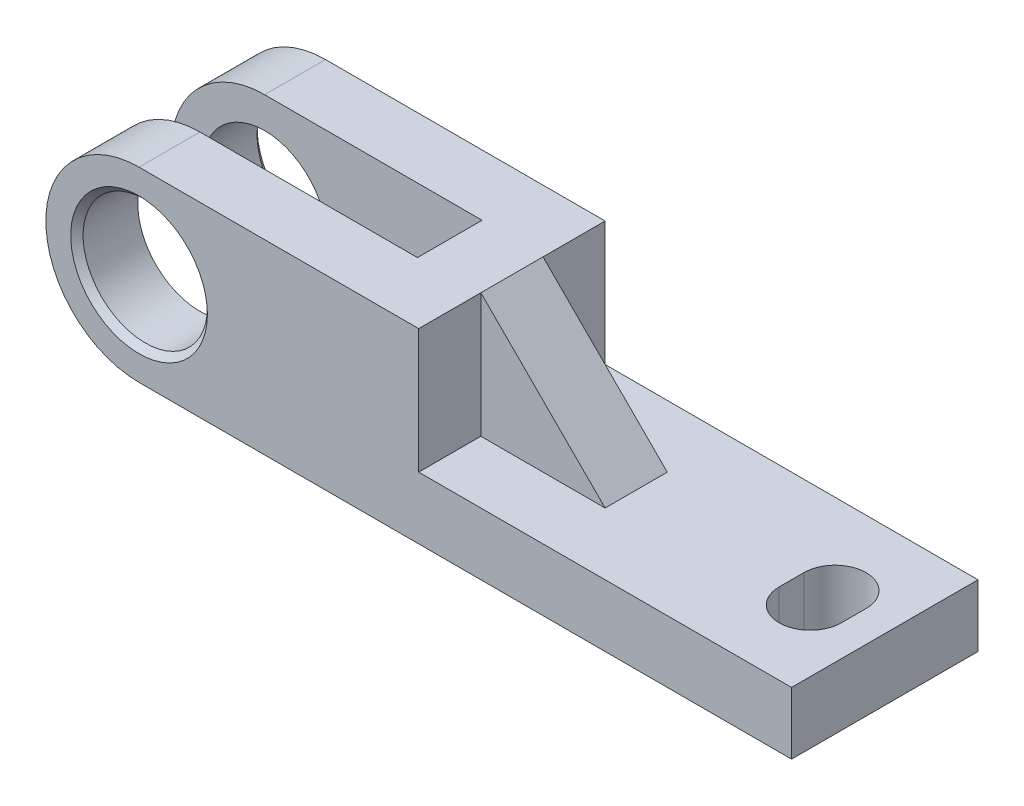
ISO-10303-21;
HEADER;
FILE_DESCRIPTION(('STEP AP214'),'2;1');
FILE_NAME('part.step','',(''),(''),'','','');
FILE_SCHEMA(('AUTOMOTIVE_DESIGN { 1 0 10303 214 1 1 1 1 }'));
ENDSEC;
DATA;
#1=APPLICATION_CONTEXT('core data for automotive mechanical design processes');
#2=APPLICATION_PROTOCOL_DEFINITION('international standard','automotive_design',2000,#1);
#3=PRODUCT_CONTEXT('',#1,'mechanical');
#4=PRODUCT('Part','Part','',(#3));
#5=PRODUCT_RELATED_PRODUCT_CATEGORY('part','',(#4));
#6=PRODUCT_DEFINITION_FORMATION('','',#4);
#7=PRODUCT_DEFINITION_CONTEXT('part definition',#1,'design');
#8=PRODUCT_DEFINITION('design','',#6,#7);
#9=PRODUCT_DEFINITION_SHAPE('','',#8);
#10=(LENGTH_UNIT() NAMED_UNIT(*) SI_UNIT(.MILLI.,.METRE.));
#11=(NAMED_UNIT(*) PLANE_ANGLE_UNIT() SI_UNIT($,.RADIAN.));
#12=(NAMED_UNIT(*) SI_UNIT($,.STERADIAN.) SOLID_ANGLE_UNIT());
#13=UNCERTAINTY_MEASURE_WITH_UNIT(LENGTH_MEASURE(1.E-05),#10,'distance_accuracy_value','');
#14=(GEOMETRIC_REPRESENTATION_CONTEXT(3) GLOBAL_UNCERTAINTY_ASSIGNED_CONTEXT((#13)) GLOBAL_UNIT_ASSIGNED_CONTEXT((#10,
#11,#12)) REPRESENTATION_CONTEXT('',''));
#15=CARTESIAN_POINT('',(0.,0.,0.));
#16=DIRECTION('',(0.,0.,1.));
#17=DIRECTION('',(1.,0.,0.));
#18=AXIS2_PLACEMENT_3D('',#15,#16,#17);
#19=CARTESIAN_POINT('',(21.6358024691358,0.,30.));
#20=DIRECTION('',(-1.,0.,0.));
#21=DIRECTION('',(0.,0.,1.));
#22=AXIS2_PLACEMENT_3D('',#19,#20,#21);
#23=PLANE('',#22);
#24=DIRECTION('',(0.,1.,0.));
#25=VECTOR('',#24,1.);
#26=CARTESIAN_POINT('',(21.6358024691358,0.,10.));
#27=LINE('',#26,#25);
#28=CARTESIAN_POINT('',(21.6358024691358,0.,10.));
#29=VERTEX_POINT('',#28);
#30=CARTESIAN_POINT('',(21.6358024691358,20.,10.));
#31=VERTEX_POINT('',#30);
#32=EDGE_CURVE('E175',#29,#31,#27,.T.);
#33=ORIENTED_EDGE('',*,*,#32,.F.);
#34=DIRECTION('',(0.,0.,-1.));
#35=VECTOR('',#34,1.);
#36=CARTESIAN_POINT('',(21.6358024691358,0.,30.));
#37=LINE('',#36,#35);
#38=CARTESIAN_POINT('',(21.6358024691358,0.,0.));
#39=VERTEX_POINT('',#38);
#40=EDGE_CURVE('E183',#29,#39,#37,.T.);
#41=ORIENTED_EDGE('',*,*,#40,.T.);
#42=DIRECTION('',(0.,1.,0.));
#43=VECTOR('',#42,1.);
#44=CARTESIAN_POINT('',(21.6358024691358,0.,0.));
#45=LINE('',#44,#43);
#46=CARTESIAN_POINT('',(21.6358024691358,20.,0.));
#47=VERTEX_POINT('',#46);
#48=EDGE_CURVE('E263',#39,#47,#45,.T.);
#49=ORIENTED_EDGE('',*,*,#48,.T.);
#50=DIRECTION('',(0.,0.,-1.));
#51=VECTOR('',#50,1.);
#52=CARTESIAN_POINT('',(21.6358024691358,20.,30.));
#53=LINE('',#52,#51);
#54=EDGE_CURVE('E254',#31,#47,#53,.T.);
#55=ORIENTED_EDGE('',*,*,#54,.F.);
#56=EDGE_LOOP('',(#33,#41,#49,#55));
#57=FACE_BOUND('',#56,.T.);
#58=ADVANCED_FACE('F40',(#57),#23,.F.);
#59=CARTESIAN_POINT('',(71.6358024691358,0.,17.));
#60=DIRECTION('',(0.,1.,0.));
#61=DIRECTION('',(-1.,0.,0.));
#62=AXIS2_PLACEMENT_3D('',#59,#60,#61);
#63=CYLINDRICAL_SURFACE('',#62,5.);
#64=DIRECTION('',(0.,-1.,0.));
#65=VECTOR('',#64,1.);
#66=CARTESIAN_POINT('',(66.6358024691358,0.,17.));
#67=LINE('',#66,#65);
#68=CARTESIAN_POINT('',(66.6358024691358,0.,17.));
#69=VERTEX_POINT('',#68);
#70=CARTESIAN_POINT('',(66.6358024691358,-10.,17.));
#71=VERTEX_POINT('',#70);
#72=EDGE_CURVE('E330',#69,#71,#67,.T.);
#73=ORIENTED_EDGE('',*,*,#72,.F.);
#74=CARTESIAN_POINT('',(71.6358024691358,0.,17.));
#75=DIRECTION('',(0.,-1.,0.));
#76=DIRECTION('',(1.,0.,0.));
#77=AXIS2_PLACEMENT_3D('',#74,#75,#76);
#78=CIRCLE('',#77,5.);
#79=CARTESIAN_POINT('',(76.6358024691358,0.,17.));
#80=VERTEX_POINT('',#79);
#81=EDGE_CURVE('E338',#69,#80,#78,.F.);
#82=ORIENTED_EDGE('',*,*,#81,.T.);
#83=DIRECTION('',(0.,-1.,0.));
#84=VECTOR('',#83,1.);
#85=CARTESIAN_POINT('',(76.6358024691358,0.,17.));
#86=LINE('',#85,#84);
#87=CARTESIAN_POINT('',(76.6358024691358,-10.,17.));
#88=VERTEX_POINT('',#87);
#89=EDGE_CURVE('E334',#88,#80,#86,.F.);
#90=ORIENTED_EDGE('',*,*,#89,.F.);
#91=CARTESIAN_POINT('',(71.6358024691358,-10.,17.));
#92=DIRECTION('',(0.,1.,0.));
#93=DIRECTION('',(0.,0.,1.));
#94=AXIS2_PLACEMENT_3D('',#91,#92,#93);
#95=CIRCLE('',#94,5.);
#96=EDGE_CURVE('E65',#88,#71,#95,.F.);
#97=ORIENTED_EDGE('',*,*,#96,.T.);
#98=EDGE_LOOP('',(#73,#82,#90,#97));
#99=FACE_BOUND('',#98,.T.);
#100=ADVANCED_FACE('F371',(#99),#63,.F.);
#101=CARTESIAN_POINT('',(71.6358024691358,-10.,13.));
#102=DIRECTION('',(0.,1.,0.));
#103=DIRECTION('',(-1.,0.,0.));
#104=AXIS2_PLACEMENT_3D('',#101,#102,#103);
#105=CYLINDRICAL_SURFACE('',#104,5.);
#106=DIRECTION('',(0.,-1.,0.));
#107=VECTOR('',#106,1.);
#108=CARTESIAN_POINT('',(66.6358024691358,-10.,13.));
#109=LINE('',#108,#107);
#110=CARTESIAN_POINT('',(66.6358024691358,-10.,13.));
#111=VERTEX_POINT('',#110);
#112=CARTESIAN_POINT('',(66.6358024691358,0.,13.));
#113=VERTEX_POINT('',#112);
#114=EDGE_CURVE('E315',#111,#113,#109,.F.);
#115=ORIENTED_EDGE('',*,*,#114,.F.);
#116=CARTESIAN_POINT('',(71.6358024691358,-10.,13.));
#117=DIRECTION('',(0.,1.,0.));
#118=DIRECTION('',(0.,0.,1.));
#119=AXIS2_PLACEMENT_3D('',#116,#117,#118);
#120=CIRCLE('',#119,5.);
#121=CARTESIAN_POINT('',(76.6358024691358,-10.,13.));
#122=VERTEX_POINT('',#121);
#123=EDGE_CURVE('E323',#111,#122,#120,.F.);
#124=ORIENTED_EDGE('',*,*,#123,.T.);
#125=DIRECTION('',(0.,-1.,0.));
#126=VECTOR('',#125,1.);
#127=CARTESIAN_POINT('',(76.6358024691358,-10.,13.));
#128=LINE('',#127,#126);
#129=CARTESIAN_POINT('',(76.6358024691358,0.,13.));
#130=VERTEX_POINT('',#129);
#131=EDGE_CURVE('E319',#130,#122,#128,.T.);
#132=ORIENTED_EDGE('',*,*,#131,.F.);
#133=CARTESIAN_POINT('',(71.6358024691358,0.,13.));
#134=DIRECTION('',(0.,-1.,0.));
#135=DIRECTION('',(1.,0.,0.));
#136=AXIS2_PLACEMENT_3D('',#133,#134,#135);
#137=CIRCLE('',#136,5.);
#138=EDGE_CURVE('E327',#130,#113,#137,.F.);
#139=ORIENTED_EDGE('',*,*,#138,.T.);
#140=EDGE_LOOP('',(#115,#124,#132,#139));
#141=FACE_BOUND('',#140,.T.);
#142=ADVANCED_FACE('F378',(#141),#105,.F.);
#143=CARTESIAN_POINT('',(-23.3641975308642,4.99999999999999,20.2));
#144=DIRECTION('',(0.,0.,-1.));
#145=DIRECTION('',(-1.,0.,0.));
#146=AXIS2_PLACEMENT_3D('',#143,#144,#145);
#147=CYLINDRICAL_SURFACE('',#146,15.);
#148=DIRECTION('',(0.,0.,-1.));
#149=VECTOR('',#148,1.);
#150=CARTESIAN_POINT('',(-23.3641975308642,20.,30.));
#151=LINE('',#150,#149);
#152=CARTESIAN_POINT('',(-23.3641975308642,20.,20.2));
#153=VERTEX_POINT('',#152);
#154=CARTESIAN_POINT('',(-23.3641975308642,20.,30.));
#155=VERTEX_POINT('',#154);
#156=EDGE_CURVE('E301',#153,#155,#151,.F.);
#157=ORIENTED_EDGE('',*,*,#156,.F.);
#158=CARTESIAN_POINT('',(-23.3641975308642,4.99999999999999,20.2));
#159=DIRECTION('',(0.,0.,1.));
#160=DIRECTION('',(1.,0.,0.));
#161=AXIS2_PLACEMENT_3D('',#158,#159,#160);
#162=CIRCLE('',#161,15.);
#163=CARTESIAN_POINT('',(-23.3641975308642,-10.,20.2));
#164=VERTEX_POINT('',#163);
#165=EDGE_CURVE('E309',#164,#153,#162,.F.);
#166=ORIENTED_EDGE('',*,*,#165,.F.);
#167=DIRECTION('',(0.,0.,-1.));
#168=VECTOR('',#167,1.);
#169=CARTESIAN_POINT('',(-23.3641975308642,-10.,30.));
#170=LINE('',#169,#168);
#171=CARTESIAN_POINT('',(-23.3641975308642,-10.,30.));
#172=VERTEX_POINT('',#171);
#173=EDGE_CURVE('E305',#172,#164,#170,.T.);
#174=ORIENTED_EDGE('',*,*,#173,.F.);
#175=CARTESIAN_POINT('',(-23.3641975308642,4.99999999999999,30.));
#176=DIRECTION('',(0.,0.,1.));
#177=DIRECTION('',(1.,0.,0.));
#178=AXIS2_PLACEMENT_3D('',#175,#176,#177);
#179=CIRCLE('',#178,15.);
#180=EDGE_CURVE('E312',#155,#172,#179,.T.);
#181=ORIENTED_EDGE('',*,*,#180,.F.);
#182=EDGE_LOOP('',(#157,#166,#174,#181));
#183=FACE_BOUND('',#182,.T.);
#184=ADVANCED_FACE('F485',(#183),#147,.T.);
#185=CARTESIAN_POINT('',(-23.3641975308642,5.,0.));
#186=DIRECTION('',(0.,0.,-1.));
#187=DIRECTION('',(-1.,0.,0.));
#188=AXIS2_PLACEMENT_3D('',#185,#186,#187);
#189=CYLINDRICAL_SURFACE('',#188,15.);
#190=DIRECTION('',(0.,0.,-1.));
#191=VECTOR('',#190,1.);
#192=CARTESIAN_POINT('',(-23.3641975308642,20.,30.));
#193=LINE('',#192,#191);
#194=CARTESIAN_POINT('',(-23.3641975308642,20.,0.));
#195=VERTEX_POINT('',#194);
#196=CARTESIAN_POINT('',(-23.3641975308642,20.,9.8));
#197=VERTEX_POINT('',#196);
#198=EDGE_CURVE('E287',#195,#197,#193,.F.);
#199=ORIENTED_EDGE('',*,*,#198,.F.);
#200=CARTESIAN_POINT('',(-23.3641975308642,5.,0.));
#201=DIRECTION('',(0.,0.,1.));
#202=DIRECTION('',(1.,0.,0.));
#203=AXIS2_PLACEMENT_3D('',#200,#201,#202);
#204=CIRCLE('',#203,15.);
#205=CARTESIAN_POINT('',(-23.3641975308642,-10.,0.));
#206=VERTEX_POINT('',#205);
#207=EDGE_CURVE('E295',#206,#195,#204,.F.);
#208=ORIENTED_EDGE('',*,*,#207,.F.);
#209=DIRECTION('',(0.,0.,-1.));
#210=VECTOR('',#209,1.);
#211=CARTESIAN_POINT('',(-23.3641975308642,-10.,30.));
#212=LINE('',#211,#210);
#213=CARTESIAN_POINT('',(-23.3641975308642,-10.,9.8));
#214=VERTEX_POINT('',#213);
#215=EDGE_CURVE('E291',#214,#206,#212,.T.);
#216=ORIENTED_EDGE('',*,*,#215,.F.);
#217=CARTESIAN_POINT('',(-23.3641975308642,5.,9.8));
#218=DIRECTION('',(0.,0.,-1.));
#219=DIRECTION('',(-1.,0.,0.));
#220=AXIS2_PLACEMENT_3D('',#217,#218,#219);
#221=CIRCLE('',#220,15.);
#222=EDGE_CURVE('E298',#197,#214,#221,.F.);
#223=ORIENTED_EDGE('',*,*,#222,.F.);
#224=EDGE_LOOP('',(#199,#208,#216,#223));
#225=FACE_BOUND('',#224,.T.);
#226=ADVANCED_FACE('F478',(#225),#189,.T.);
#227=CARTESIAN_POINT('',(-38.3641975308642,-10.,30.));
#228=DIRECTION('',(0.,1.,0.));
#229=DIRECTION('',(0.,0.,1.));
#230=AXIS2_PLACEMENT_3D('',#227,#228,#229);
#231=PLANE('',#230);
#232=ORIENTED_EDGE('',*,*,#96,.F.);
#233=DIRECTION('',(0.,0.,-1.));
#234=VECTOR('',#233,1.);
#235=CARTESIAN_POINT('',(76.6358024691358,-10.,8.));
#236=LINE('',#235,#234);
#237=EDGE_CURVE('E198',#88,#122,#236,.T.);
#238=ORIENTED_EDGE('',*,*,#237,.T.);
#239=ORIENTED_EDGE('',*,*,#123,.F.);
#240=DIRECTION('',(0.,0.,1.));
#241=VECTOR('',#240,1.);
#242=CARTESIAN_POINT('',(66.6358024691358,-10.,8.));
#243=LINE('',#242,#241);
#244=EDGE_CURVE('E195',#111,#71,#243,.T.);
#245=ORIENTED_EDGE('',*,*,#244,.T.);
#246=EDGE_LOOP('',(#232,#238,#239,#245));
#247=FACE_BOUND('',#246,.T.);
#248=DIRECTION('',(-1.,0.,0.));
#249=VECTOR('',#248,1.);
#250=CARTESIAN_POINT('',(11.6358024691358,-10.,20.2));
#251=LINE('',#250,#249);
#252=CARTESIAN_POINT('',(11.6358024691358,-10.,20.2));
#253=VERTEX_POINT('',#252);
#254=EDGE_CURVE('E230',#253,#164,#251,.T.);
#255=ORIENTED_EDGE('',*,*,#254,.F.);
#256=DIRECTION('',(0.,0.,1.));
#257=VECTOR('',#256,1.);
#258=CARTESIAN_POINT('',(11.6358024691358,-10.,9.8));
#259=LINE('',#258,#257);
#260=CARTESIAN_POINT('',(11.6358024691358,-10.,9.8));
#261=VERTEX_POINT('',#260);
#262=EDGE_CURVE('E211',#261,#253,#259,.T.);
#263=ORIENTED_EDGE('',*,*,#262,.F.);
#264=DIRECTION('',(-1.,0.,0.));
#265=VECTOR('',#264,1.);
#266=CARTESIAN_POINT('',(11.6358024691358,-10.,9.8));
#267=LINE('',#266,#265);
#268=EDGE_CURVE('E220',#261,#214,#267,.T.);
#269=ORIENTED_EDGE('',*,*,#268,.T.);
#270=ORIENTED_EDGE('',*,*,#215,.T.);
#271=DIRECTION('',(1.,0.,0.));
#272=VECTOR('',#271,1.);
#273=CARTESIAN_POINT('',(-38.3641975308642,-10.,0.));
#274=LINE('',#273,#272);
#275=CARTESIAN_POINT('',(81.6358024691358,-10.,0.));
#276=VERTEX_POINT('',#275);
#277=EDGE_CURVE('E225',#206,#276,#274,.T.);
#278=ORIENTED_EDGE('',*,*,#277,.T.);
#279=DIRECTION('',(0.,0.,-1.));
#280=VECTOR('',#279,1.);
#281=CARTESIAN_POINT('',(81.6358024691358,-10.,30.));
#282=LINE('',#281,#280);
#283=CARTESIAN_POINT('',(81.6358024691358,-10.,30.));
#284=VERTEX_POINT('',#283);
#285=EDGE_CURVE('E283',#284,#276,#282,.T.);
#286=ORIENTED_EDGE('',*,*,#285,.F.);
#287=DIRECTION('',(1.,0.,0.));
#288=VECTOR('',#287,1.);
#289=CARTESIAN_POINT('',(-38.3641975308642,-10.,30.));
#290=LINE('',#289,#288);
#291=EDGE_CURVE('E237',#172,#284,#290,.T.);
#292=ORIENTED_EDGE('',*,*,#291,.F.);
#293=ORIENTED_EDGE('',*,*,#173,.T.);
#294=EDGE_LOOP('',(#255,#263,#269,#270,#278,#286,#292,#293));
#295=FACE_BOUND('',#294,.T.);
#296=ADVANCED_FACE('F460',(#247,#295),#231,.F.);
#297=CARTESIAN_POINT('',(81.6358024691358,-10.,30.));
#298=DIRECTION('',(-1.,0.,0.));
#299=DIRECTION('',(0.,0.,1.));
#300=AXIS2_PLACEMENT_3D('',#297,#298,#299);
#301=PLANE('',#300);
#302=DIRECTION('',(0.,1.,0.));
#303=VECTOR('',#302,1.);
#304=CARTESIAN_POINT('',(81.6358024691358,-10.,0.));
#305=LINE('',#304,#303);
#306=CARTESIAN_POINT('',(81.6358024691358,0.,0.));
#307=VERTEX_POINT('',#306);
#308=EDGE_CURVE('E257',#276,#307,#305,.T.);
#309=ORIENTED_EDGE('',*,*,#308,.T.);
#310=DIRECTION('',(0.,0.,-1.));
#311=VECTOR('',#310,1.);
#312=CARTESIAN_POINT('',(81.6358024691358,0.,30.));
#313=LINE('',#312,#311);
#314=CARTESIAN_POINT('',(81.6358024691358,0.,30.));
#315=VERTEX_POINT('',#314);
#316=EDGE_CURVE('E279',#315,#307,#313,.T.);
#317=ORIENTED_EDGE('',*,*,#316,.F.);
#318=DIRECTION('',(0.,1.,0.));
#319=VECTOR('',#318,1.);
#320=CARTESIAN_POINT('',(81.6358024691358,-10.,30.));
#321=LINE('',#320,#319);
#322=EDGE_CURVE('E240',#284,#315,#321,.T.);
#323=ORIENTED_EDGE('',*,*,#322,.F.);
#324=ORIENTED_EDGE('',*,*,#285,.T.);
#325=EDGE_LOOP('',(#309,#317,#323,#324));
#326=FACE_BOUND('',#325,.T.);
#327=ADVANCED_FACE('F392',(#326),#301,.F.);
#328=CARTESIAN_POINT('',(81.6358024691358,0.,30.));
#329=DIRECTION('',(0.,-1.,0.));
#330=DIRECTION('',(1.,0.,0.));
#331=AXIS2_PLACEMENT_3D('',#328,#329,#330);
#332=PLANE('',#331);
#333=ORIENTED_EDGE('',*,*,#81,.F.);
#334=DIRECTION('',(0.,0.,1.));
#335=VECTOR('',#334,1.);
#336=CARTESIAN_POINT('',(66.6358024691358,0.,8.));
#337=LINE('',#336,#335);
#338=EDGE_CURVE('E168',#113,#69,#337,.T.);
#339=ORIENTED_EDGE('',*,*,#338,.F.);
#340=ORIENTED_EDGE('',*,*,#138,.F.);
#341=DIRECTION('',(0.,0.,-1.));
#342=VECTOR('',#341,1.);
#343=CARTESIAN_POINT('',(76.6358024691358,0.,8.));
#344=LINE('',#343,#342);
#345=EDGE_CURVE('E199',#80,#130,#344,.T.);
#346=ORIENTED_EDGE('',*,*,#345,.F.);
#347=EDGE_LOOP('',(#333,#339,#340,#346));
#348=FACE_BOUND('',#347,.T.);
#349=DIRECTION('',(0.,0.,-1.));
#350=VECTOR('',#349,1.);
#351=CARTESIAN_POINT('',(41.6358024691358,0.,30.));
#352=LINE('',#351,#350);
#353=CARTESIAN_POINT('',(41.6358024691358,0.,10.));
#354=VERTEX_POINT('',#353);
#355=CARTESIAN_POINT('',(41.6358024691358,0.,20.));
#356=VERTEX_POINT('',#355);
#357=EDGE_CURVE('E160',#354,#356,#352,.F.);
#358=ORIENTED_EDGE('',*,*,#357,.T.);
#359=DIRECTION('',(-1.,0.,0.));
#360=VECTOR('',#359,1.);
#361=CARTESIAN_POINT('',(81.6358024691358,0.,20.));
#362=LINE('',#361,#360);
#363=CARTESIAN_POINT('',(21.6358024691358,0.,20.));
#364=VERTEX_POINT('',#363);
#365=EDGE_CURVE('E169',#356,#364,#362,.T.);
#366=ORIENTED_EDGE('',*,*,#365,.T.);
#367=CARTESIAN_POINT('',(21.6358024691358,0.,30.));
#368=VERTEX_POINT('',#367);
#369=EDGE_CURVE('E275',#368,#364,#37,.T.);
#370=ORIENTED_EDGE('',*,*,#369,.F.);
#371=DIRECTION('',(-1.,0.,0.));
#372=VECTOR('',#371,1.);
#373=CARTESIAN_POINT('',(81.6358024691358,0.,30.));
#374=LINE('',#373,#372);
#375=EDGE_CURVE('E244',#315,#368,#374,.T.);
#376=ORIENTED_EDGE('',*,*,#375,.F.);
#377=ORIENTED_EDGE('',*,*,#316,.T.);
#378=DIRECTION('',(-1.,0.,0.));
#379=VECTOR('',#378,1.);
#380=CARTESIAN_POINT('',(81.6358024691358,0.,0.));
#381=LINE('',#380,#379);
#382=EDGE_CURVE('E260',#307,#39,#381,.T.);
#383=ORIENTED_EDGE('',*,*,#382,.T.);
#384=ORIENTED_EDGE('',*,*,#40,.F.);
#385=DIRECTION('',(-1.,0.,0.));
#386=VECTOR('',#385,1.);
#387=CARTESIAN_POINT('',(81.6358024691358,0.,10.));
#388=LINE('',#387,#386);
#389=EDGE_CURVE('E173',#354,#29,#388,.T.);
#390=ORIENTED_EDGE('',*,*,#389,.F.);
#391=EDGE_LOOP('',(#358,#366,#370,#376,#377,#383,#384,#390));
#392=FACE_BOUND('',#391,.T.);
#393=ADVANCED_FACE('F181',(#348,#392),#332,.F.);
#394=ORIENTED_EDGE('',*,*,#369,.T.);
#395=DIRECTION('',(0.,1.,0.));
#396=VECTOR('',#395,1.);
#397=CARTESIAN_POINT('',(21.6358024691358,0.,20.));
#398=LINE('',#397,#396);
#399=CARTESIAN_POINT('',(21.6358024691358,20.,20.));
#400=VERTEX_POINT('',#399);
#401=EDGE_CURVE('E185',#364,#400,#398,.T.);
#402=ORIENTED_EDGE('',*,*,#401,.T.);
#403=CARTESIAN_POINT('',(21.6358024691358,20.,30.));
#404=VERTEX_POINT('',#403);
#405=EDGE_CURVE('E270',#404,#400,#53,.T.);
#406=ORIENTED_EDGE('',*,*,#405,.F.);
#407=DIRECTION('',(0.,1.,0.));
#408=VECTOR('',#407,1.);
#409=CARTESIAN_POINT('',(21.6358024691358,0.,30.));
#410=LINE('',#409,#408);
#411=EDGE_CURVE('E247',#368,#404,#410,.T.);
#412=ORIENTED_EDGE('',*,*,#411,.F.);
#413=EDGE_LOOP('',(#394,#402,#406,#412));
#414=FACE_BOUND('',#413,.T.);
#415=ADVANCED_FACE('F374',(#414),#23,.F.);
#416=CARTESIAN_POINT('',(21.6358024691358,20.,30.));
#417=DIRECTION('',(0.,-1.,0.));
#418=DIRECTION('',(1.,0.,0.));
#419=AXIS2_PLACEMENT_3D('',#416,#417,#418);
#420=PLANE('',#419);
#421=ORIENTED_EDGE('',*,*,#405,.T.);
#422=EDGE_CURVE('E274',#400,#31,#53,.T.);
#423=ORIENTED_EDGE('',*,*,#422,.T.);
#424=ORIENTED_EDGE('',*,*,#54,.T.);
#425=DIRECTION('',(-1.,0.,0.));
#426=VECTOR('',#425,1.);
#427=CARTESIAN_POINT('',(21.6358024691358,20.,0.));
#428=LINE('',#427,#426);
#429=EDGE_CURVE('E241',#47,#195,#428,.T.);
#430=ORIENTED_EDGE('',*,*,#429,.T.);
#431=ORIENTED_EDGE('',*,*,#198,.T.);
#432=DIRECTION('',(-1.,0.,0.));
#433=VECTOR('',#432,1.);
#434=CARTESIAN_POINT('',(11.6358024691358,20.,9.8));
#435=LINE('',#434,#433);
#436=CARTESIAN_POINT('',(11.6358024691358,20.,9.8));
#437=VERTEX_POINT('',#436);
#438=EDGE_CURVE('E221',#437,#197,#435,.T.);
#439=ORIENTED_EDGE('',*,*,#438,.F.);
#440=DIRECTION('',(0.,0.,-1.));
#441=VECTOR('',#440,1.);
#442=CARTESIAN_POINT('',(11.6358024691358,20.,9.8));
#443=LINE('',#442,#441);
#444=CARTESIAN_POINT('',(11.6358024691358,20.,20.2));
#445=VERTEX_POINT('',#444);
#446=EDGE_CURVE('E217',#445,#437,#443,.T.);
#447=ORIENTED_EDGE('',*,*,#446,.F.);
#448=DIRECTION('',(-1.,0.,0.));
#449=VECTOR('',#448,1.);
#450=CARTESIAN_POINT('',(11.6358024691358,20.,20.2));
#451=LINE('',#450,#449);
#452=EDGE_CURVE('E226',#445,#153,#451,.T.);
#453=ORIENTED_EDGE('',*,*,#452,.T.);
#454=ORIENTED_EDGE('',*,*,#156,.T.);
#455=DIRECTION('',(-1.,0.,0.));
#456=VECTOR('',#455,1.);
#457=CARTESIAN_POINT('',(21.6358024691358,20.,30.));
#458=LINE('',#457,#456);
#459=EDGE_CURVE('E250',#404,#155,#458,.T.);
#460=ORIENTED_EDGE('',*,*,#459,.F.);
#461=EDGE_LOOP('',(#421,#423,#424,#430,#431,#439,#447,#453,#454,#460));
#462=FACE_BOUND('',#461,.T.);
#463=ADVANCED_FACE('F384',(#462),#420,.F.);
#464=CARTESIAN_POINT('',(0.,0.,30.));
#465=DIRECTION('',(0.,0.,1.));
#466=DIRECTION('',(1.,0.,0.));
#467=AXIS2_PLACEMENT_3D('',#464,#465,#466);
#468=PLANE('',#467);
#469=CARTESIAN_POINT('',(-23.3641975308642,4.99999999999999,30.));
#470=DIRECTION('',(0.,0.,1.));
#471=DIRECTION('',(1.,0.,0.));
#472=AXIS2_PLACEMENT_3D('',#469,#470,#471);
#473=CIRCLE('',#472,11.);
#474=CARTESIAN_POINT('',(-12.3641975308642,4.99999999999999,30.));
#475=VERTEX_POINT('',#474);
#476=EDGE_CURVE('E11',#475,#475,#473,.F.);
#477=ORIENTED_EDGE('',*,*,#476,.T.);
#478=EDGE_LOOP('',(#477));
#479=FACE_BOUND('',#478,.T.);
#480=ORIENTED_EDGE('',*,*,#459,.T.);
#481=ORIENTED_EDGE('',*,*,#180,.T.);
#482=ORIENTED_EDGE('',*,*,#291,.T.);
#483=ORIENTED_EDGE('',*,*,#322,.T.);
#484=ORIENTED_EDGE('',*,*,#375,.T.);
#485=ORIENTED_EDGE('',*,*,#411,.T.);
#486=EDGE_LOOP('',(#480,#481,#482,#483,#484,#485));
#487=FACE_BOUND('',#486,.T.);
#488=ADVANCED_FACE('F390',(#479,#487),#468,.T.);
#489=CARTESIAN_POINT('',(0.,0.,0.));
#490=DIRECTION('',(0.,0.,1.));
#491=DIRECTION('',(1.,0.,0.));
#492=AXIS2_PLACEMENT_3D('',#489,#490,#491);
#493=PLANE('',#492);
#494=CARTESIAN_POINT('',(-23.3641975308642,4.99999999999999,0.));
#495=DIRECTION('',(0.,0.,1.));
#496=DIRECTION('',(1.,0.,0.));
#497=AXIS2_PLACEMENT_3D('',#494,#495,#496);
#498=CIRCLE('',#497,11.);
#499=CARTESIAN_POINT('',(-12.3641975308642,4.99999999999999,0.));
#500=VERTEX_POINT('',#499);
#501=EDGE_CURVE('E343',#500,#500,#498,.T.);
#502=ORIENTED_EDGE('',*,*,#501,.T.);
#503=EDGE_LOOP('',(#502));
#504=FACE_BOUND('',#503,.T.);
#505=ORIENTED_EDGE('',*,*,#277,.F.);
#506=ORIENTED_EDGE('',*,*,#207,.T.);
#507=ORIENTED_EDGE('',*,*,#429,.F.);
#508=ORIENTED_EDGE('',*,*,#48,.F.);
#509=ORIENTED_EDGE('',*,*,#382,.F.);
#510=ORIENTED_EDGE('',*,*,#308,.F.);
#511=EDGE_LOOP('',(#505,#506,#507,#508,#509,#510));
#512=FACE_BOUND('',#511,.T.);
#513=ADVANCED_FACE('F442',(#504,#512),#493,.F.);
#514=CARTESIAN_POINT('',(11.6358024691358,-10.,9.8));
#515=DIRECTION('',(0.,0.,-1.));
#516=DIRECTION('',(-1.,0.,0.));
#517=AXIS2_PLACEMENT_3D('',#514,#515,#516);
#518=PLANE('',#517);
#519=CARTESIAN_POINT('',(-23.3641975308642,4.99999999999999,9.8));
#520=DIRECTION('',(0.,0.,-1.));
#521=DIRECTION('',(-1.,0.,0.));
#522=AXIS2_PLACEMENT_3D('',#519,#520,#521);
#523=CIRCLE('',#522,10.);
#524=CARTESIAN_POINT('',(-33.3641975308642,4.99999999999999,9.8));
#525=VERTEX_POINT('',#524);
#526=EDGE_CURVE('E178',#525,#525,#523,.T.);
#527=ORIENTED_EDGE('',*,*,#526,.T.);
#528=EDGE_LOOP('',(#527));
#529=FACE_BOUND('',#528,.T.);
#530=ORIENTED_EDGE('',*,*,#438,.T.);
#531=ORIENTED_EDGE('',*,*,#222,.T.);
#532=ORIENTED_EDGE('',*,*,#268,.F.);
#533=DIRECTION('',(0.,-1.,0.));
#534=VECTOR('',#533,1.);
#535=CARTESIAN_POINT('',(11.6358024691358,-10.,9.8));
#536=LINE('',#535,#534);
#537=EDGE_CURVE('E202',#437,#261,#536,.T.);
#538=ORIENTED_EDGE('',*,*,#537,.F.);
#539=EDGE_LOOP('',(#530,#531,#532,#538));
#540=FACE_BOUND('',#539,.T.);
#541=ADVANCED_FACE('F407',(#529,#540),#518,.F.);
#542=CARTESIAN_POINT('',(11.6358024691358,-10.,20.2));
#543=DIRECTION('',(0.,0.,1.));
#544=DIRECTION('',(1.,0.,0.));
#545=AXIS2_PLACEMENT_3D('',#542,#543,#544);
#546=PLANE('',#545);
#547=CARTESIAN_POINT('',(-23.3641975308642,4.99999999999999,20.2));
#548=DIRECTION('',(0.,0.,1.));
#549=DIRECTION('',(1.,0.,0.));
#550=AXIS2_PLACEMENT_3D('',#547,#548,#549);
#551=CIRCLE('',#550,10.);
#552=CARTESIAN_POINT('',(-13.3641975308642,4.99999999999999,20.2));
#553=VERTEX_POINT('',#552);
#554=EDGE_CURVE('E344',#553,#553,#551,.T.);
#555=ORIENTED_EDGE('',*,*,#554,.T.);
#556=EDGE_LOOP('',(#555));
#557=FACE_BOUND('',#556,.T.);
#558=ORIENTED_EDGE('',*,*,#254,.T.);
#559=ORIENTED_EDGE('',*,*,#165,.T.);
#560=ORIENTED_EDGE('',*,*,#452,.F.);
#561=DIRECTION('',(0.,1.,0.));
#562=VECTOR('',#561,1.);
#563=CARTESIAN_POINT('',(11.6358024691358,-10.,20.2));
#564=LINE('',#563,#562);
#565=EDGE_CURVE('E214',#253,#445,#564,.T.);
#566=ORIENTED_EDGE('',*,*,#565,.F.);
#567=EDGE_LOOP('',(#558,#559,#560,#566));
#568=FACE_BOUND('',#567,.T.);
#569=ADVANCED_FACE('F435',(#557,#568),#546,.F.);
#570=CARTESIAN_POINT('',(11.6358024691358,0.,0.));
#571=DIRECTION('',(1.,0.,0.));
#572=DIRECTION('',(0.,0.,-1.));
#573=AXIS2_PLACEMENT_3D('',#570,#571,#572);
#574=PLANE('',#573);
#575=ORIENTED_EDGE('',*,*,#446,.T.);
#576=ORIENTED_EDGE('',*,*,#537,.T.);
#577=ORIENTED_EDGE('',*,*,#262,.T.);
#578=ORIENTED_EDGE('',*,*,#565,.T.);
#579=EDGE_LOOP('',(#575,#576,#577,#578));
#580=FACE_BOUND('',#579,.T.);
#581=ADVANCED_FACE('F431',(#580),#574,.F.);
#582=CARTESIAN_POINT('',(66.6358024691358,-10.,8.));
#583=DIRECTION('',(-1.,0.,0.));
#584=DIRECTION('',(0.,-1.,0.));
#585=AXIS2_PLACEMENT_3D('',#582,#583,#584);
#586=PLANE('',#585);
#587=ORIENTED_EDGE('',*,*,#338,.T.);
#588=ORIENTED_EDGE('',*,*,#72,.T.);
#589=ORIENTED_EDGE('',*,*,#244,.F.);
#590=ORIENTED_EDGE('',*,*,#114,.T.);
#591=EDGE_LOOP('',(#587,#588,#589,#590));
#592=FACE_BOUND('',#591,.T.);
#593=ADVANCED_FACE('F427',(#592),#586,.F.);
#594=CARTESIAN_POINT('',(76.6358024691358,-10.,8.));
#595=DIRECTION('',(1.,0.,0.));
#596=DIRECTION('',(0.,1.,0.));
#597=AXIS2_PLACEMENT_3D('',#594,#595,#596);
#598=PLANE('',#597);
#599=ORIENTED_EDGE('',*,*,#237,.F.);
#600=ORIENTED_EDGE('',*,*,#89,.T.);
#601=ORIENTED_EDGE('',*,*,#345,.T.);
#602=ORIENTED_EDGE('',*,*,#131,.T.);
#603=EDGE_LOOP('',(#599,#600,#601,#602));
#604=FACE_BOUND('',#603,.T.);
#605=ADVANCED_FACE('F424',(#604),#598,.F.);
#606=CARTESIAN_POINT('',(21.6358024691358,20.,15.));
#607=DIRECTION('',(-0.707106781186547,-0.707106781186548,0.));
#608=DIRECTION('',(0.707106781186548,-0.707106781186547,0.));
#609=AXIS2_PLACEMENT_3D('',#606,#607,#608);
#610=PLANE('',#609);
#611=ORIENTED_EDGE('',*,*,#357,.F.);
#612=DIRECTION('',(0.707106781186548,-0.707106781186547,0.));
#613=VECTOR('',#612,1.);
#614=CARTESIAN_POINT('',(21.6358024691358,20.,10.));
#615=LINE('',#614,#613);
#616=EDGE_CURVE('E57',#31,#354,#615,.T.);
#617=ORIENTED_EDGE('',*,*,#616,.F.);
#618=ORIENTED_EDGE('',*,*,#422,.F.);
#619=DIRECTION('',(0.707106781186548,-0.707106781186547,0.));
#620=VECTOR('',#619,1.);
#621=CARTESIAN_POINT('',(21.6358024691358,20.,20.));
#622=LINE('',#621,#620);
#623=EDGE_CURVE('E163',#400,#356,#622,.T.);
#624=ORIENTED_EDGE('',*,*,#623,.T.);
#625=EDGE_LOOP('',(#611,#617,#618,#624));
#626=FACE_BOUND('',#625,.T.);
#627=ADVANCED_FACE('F161',(#626),#610,.F.);
#628=CARTESIAN_POINT('',(21.6358024691358,5.,20.));
#629=DIRECTION('',(0.,0.,1.));
#630=DIRECTION('',(1.,0.,0.));
#631=AXIS2_PLACEMENT_3D('',#628,#629,#630);
#632=PLANE('',#631);
#633=ORIENTED_EDGE('',*,*,#365,.F.);
#634=ORIENTED_EDGE('',*,*,#623,.F.);
#635=ORIENTED_EDGE('',*,*,#401,.F.);
#636=EDGE_LOOP('',(#633,#634,#635));
#637=FACE_BOUND('',#636,.T.);
#638=ADVANCED_FACE('F399',(#637),#632,.T.);
#639=CARTESIAN_POINT('',(21.6358024691358,5.,10.));
#640=DIRECTION('',(0.,0.,1.));
#641=DIRECTION('',(1.,0.,0.));
#642=AXIS2_PLACEMENT_3D('',#639,#640,#641);
#643=PLANE('',#642);
#644=ORIENTED_EDGE('',*,*,#616,.T.);
#645=ORIENTED_EDGE('',*,*,#389,.T.);
#646=ORIENTED_EDGE('',*,*,#32,.T.);
#647=EDGE_LOOP('',(#644,#645,#646));
#648=FACE_BOUND('',#647,.T.);
#649=ADVANCED_FACE('F172',(#648),#643,.F.);
#650=CARTESIAN_POINT('',(-23.3641975308642,4.99999999999999,30.));
#651=DIRECTION('',(0.,0.,1.));
#652=DIRECTION('',(1.,0.,0.));
#653=AXIS2_PLACEMENT_3D('',#650,#651,#652);
#654=CYLINDRICAL_SURFACE('',#653,10.);
#655=CARTESIAN_POINT('',(-23.3641975308642,4.99999999999999,29.));
#656=DIRECTION('',(0.,0.,1.));
#657=DIRECTION('',(1.,0.,0.));
#658=AXIS2_PLACEMENT_3D('',#655,#656,#657);
#659=CIRCLE('',#658,10.);
#660=CARTESIAN_POINT('',(-13.3641975308642,4.99999999999999,29.));
#661=VERTEX_POINT('',#660);
#662=EDGE_CURVE('E50',#661,#661,#659,.T.);
#663=ORIENTED_EDGE('',*,*,#662,.T.);
#664=EDGE_LOOP('',(#663));
#665=FACE_BOUND('',#664,.T.);
#666=ORIENTED_EDGE('',*,*,#554,.F.);
#667=EDGE_LOOP('',(#666));
#668=FACE_BOUND('',#667,.T.);
#669=ADVANCED_FACE('F358',(#665,#668),#654,.F.);
#670=CARTESIAN_POINT('',(-23.3641975308642,4.99999999999999,0.999999999999994));
#671=DIRECTION('',(0.,0.,1.));
#672=DIRECTION('',(1.,0.,0.));
#673=AXIS2_PLACEMENT_3D('',#670,#671,#672);
#674=CIRCLE('',#673,10.);
#675=CARTESIAN_POINT('',(-13.3641975308642,4.99999999999999,0.999999999999994));
#676=VERTEX_POINT('',#675);
#677=EDGE_CURVE('E351',#676,#676,#674,.F.);
#678=ORIENTED_EDGE('',*,*,#677,.T.);
#679=EDGE_LOOP('',(#678));
#680=FACE_BOUND('',#679,.T.);
#681=ORIENTED_EDGE('',*,*,#526,.F.);
#682=EDGE_LOOP('',(#681));
#683=FACE_BOUND('',#682,.T.);
#684=ADVANCED_FACE('F367',(#680,#683),#654,.F.);
#685=CARTESIAN_POINT('',(-23.3641975308642,4.99999999999999,0.));
#686=DIRECTION('',(0.,0.,-1.));
#687=DIRECTION('',(-1.,0.,0.));
#688=AXIS2_PLACEMENT_3D('',#685,#686,#687);
#689=CONICAL_SURFACE('',#688,11.,0.785398163397444);
#690=ORIENTED_EDGE('',*,*,#677,.F.);
#691=EDGE_LOOP('',(#690));
#692=FACE_BOUND('',#691,.T.);
#693=ORIENTED_EDGE('',*,*,#501,.F.);
#694=EDGE_LOOP('',(#693));
#695=FACE_BOUND('',#694,.T.);
#696=ADVANCED_FACE('F362',(#692,#695),#689,.F.);
#697=CARTESIAN_POINT('',(-23.3641975308642,4.99999999999999,29.));
#698=DIRECTION('',(0.,0.,1.));
#699=DIRECTION('',(1.,0.,0.));
#700=AXIS2_PLACEMENT_3D('',#697,#698,#699);
#701=CONICAL_SURFACE('',#700,10.,0.785398163397444);
#702=ORIENTED_EDGE('',*,*,#476,.F.);
#703=EDGE_LOOP('',(#702));
#704=FACE_BOUND('',#703,.T.);
#705=ORIENTED_EDGE('',*,*,#662,.F.);
#706=EDGE_LOOP('',(#705));
#707=FACE_BOUND('',#706,.T.);
#708=ADVANCED_FACE('F43',(#704,#707),#701,.F.);
#709=CLOSED_SHELL('',(#58,#100,#142,#184,#226,#296,#327,#393,#415,#463,#488,#513,#541,#569,#581,
#593,#605,#627,#638,#649,#669,#684,#696,#708));
#710=MANIFOLD_SOLID_BREP('B2',#709);
#711=ADVANCED_BREP_SHAPE_REPRESENTATION('',(#18,#710),#14);
#712=SHAPE_DEFINITION_REPRESENTATION(#9,#711);
ENDSEC;
END-ISO-10303-21;
